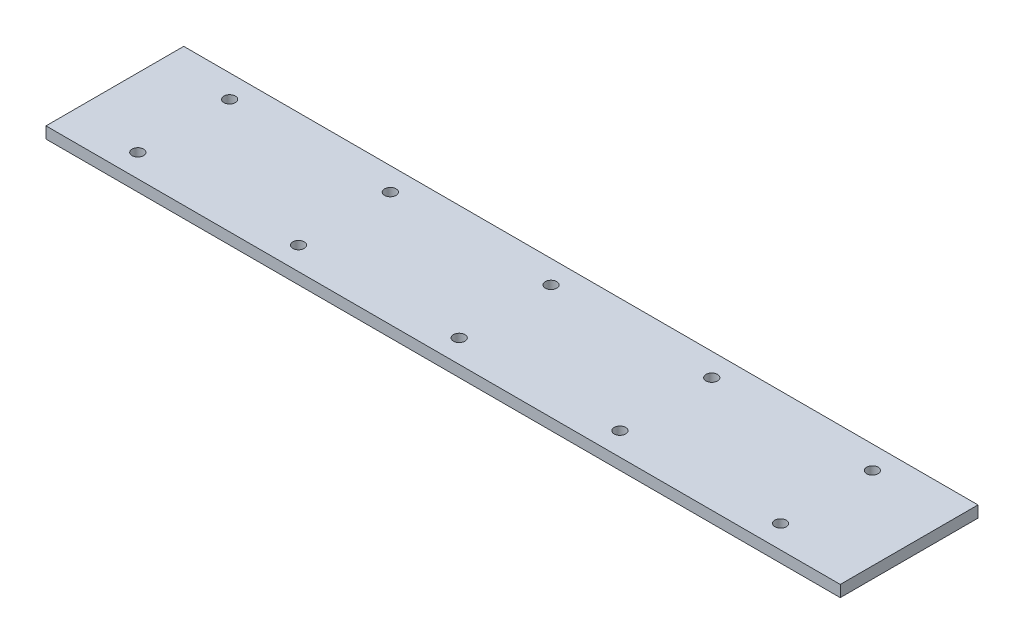
ISO-10303-21;
HEADER;
FILE_DESCRIPTION(('STEP AP214'),'2;1');
FILE_NAME('part.step','',(''),(''),'','','');
FILE_SCHEMA(('AUTOMOTIVE_DESIGN { 1 0 10303 214 1 1 1 1 }'));
ENDSEC;
DATA;
#1=APPLICATION_CONTEXT('core data for automotive mechanical design processes');
#2=APPLICATION_PROTOCOL_DEFINITION('international standard','automotive_design',2000,#1);
#3=PRODUCT_CONTEXT('',#1,'mechanical');
#4=PRODUCT('Part','Part','',(#3));
#5=PRODUCT_RELATED_PRODUCT_CATEGORY('part','',(#4));
#6=PRODUCT_DEFINITION_FORMATION('','',#4);
#7=PRODUCT_DEFINITION_CONTEXT('part definition',#1,'design');
#8=PRODUCT_DEFINITION('design','',#6,#7);
#9=PRODUCT_DEFINITION_SHAPE('','',#8);
#10=(LENGTH_UNIT() NAMED_UNIT(*) SI_UNIT(.MILLI.,.METRE.));
#11=(NAMED_UNIT(*) PLANE_ANGLE_UNIT() SI_UNIT($,.RADIAN.));
#12=(NAMED_UNIT(*) SI_UNIT($,.STERADIAN.) SOLID_ANGLE_UNIT());
#13=UNCERTAINTY_MEASURE_WITH_UNIT(LENGTH_MEASURE(1.E-05),#10,'distance_accuracy_value','');
#14=(GEOMETRIC_REPRESENTATION_CONTEXT(3) GLOBAL_UNCERTAINTY_ASSIGNED_CONTEXT((#13)) GLOBAL_UNIT_ASSIGNED_CONTEXT((#10,
#11,#12)) REPRESENTATION_CONTEXT('',''));
#15=CARTESIAN_POINT('',(0.,0.,0.));
#16=DIRECTION('',(0.,0.,1.));
#17=DIRECTION('',(1.,0.,0.));
#18=AXIS2_PLACEMENT_3D('',#15,#16,#17);
#19=CARTESIAN_POINT('',(0.,5.,0.));
#20=DIRECTION('',(0.,-1.,0.));
#21=DIRECTION('',(0.,0.,-1.));
#22=AXIS2_PLACEMENT_3D('',#19,#20,#21);
#23=PLANE('',#22);
#24=DIRECTION('',(0.,0.,1.));
#25=VECTOR('',#24,1.);
#26=CARTESIAN_POINT('',(0.,5.,0.));
#27=LINE('',#26,#25);
#28=CARTESIAN_POINT('',(0.,5.,-60.));
#29=VERTEX_POINT('',#28);
#30=CARTESIAN_POINT('',(0.,5.,0.));
#31=VERTEX_POINT('',#30);
#32=EDGE_CURVE('E98',#29,#31,#27,.T.);
#33=ORIENTED_EDGE('',*,*,#32,.T.);
#34=DIRECTION('',(1.,0.,0.));
#35=VECTOR('',#34,1.);
#36=CARTESIAN_POINT('',(0.,5.,0.));
#37=LINE('',#36,#35);
#38=CARTESIAN_POINT('',(346.,5.,0.));
#39=VERTEX_POINT('',#38);
#40=EDGE_CURVE('E93',#31,#39,#37,.T.);
#41=ORIENTED_EDGE('',*,*,#40,.T.);
#42=DIRECTION('',(0.,0.,-1.));
#43=VECTOR('',#42,1.);
#44=CARTESIAN_POINT('',(346.,5.,0.));
#45=LINE('',#44,#43);
#46=CARTESIAN_POINT('',(346.,5.,-60.));
#47=VERTEX_POINT('',#46);
#48=EDGE_CURVE('E96',#39,#47,#45,.T.);
#49=ORIENTED_EDGE('',*,*,#48,.T.);
#50=DIRECTION('',(-1.,0.,0.));
#51=VECTOR('',#50,1.);
#52=CARTESIAN_POINT('',(0.,5.,-60.));
#53=LINE('',#52,#51);
#54=EDGE_CURVE('E63',#47,#29,#53,.T.);
#55=ORIENTED_EDGE('',*,*,#54,.T.);
#56=EDGE_LOOP('',(#33,#41,#49,#55));
#57=FACE_BOUND('',#56,.T.);
#58=CARTESIAN_POINT('',(30.,5.,-50.));
#59=DIRECTION('',(0.,1.,0.));
#60=DIRECTION('',(0.,0.,1.));
#61=AXIS2_PLACEMENT_3D('',#58,#59,#60);
#62=CIRCLE('',#61,2.5);
#63=CARTESIAN_POINT('',(30.,5.,-47.5));
#64=VERTEX_POINT('',#63);
#65=EDGE_CURVE('E118',#64,#64,#62,.T.);
#66=ORIENTED_EDGE('',*,*,#65,.F.);
#67=EDGE_LOOP('',(#66));
#68=FACE_BOUND('',#67,.T.);
#69=CARTESIAN_POINT('',(100.,5.,-50.));
#70=DIRECTION('',(0.,1.,0.));
#71=DIRECTION('',(0.,0.,1.));
#72=AXIS2_PLACEMENT_3D('',#69,#70,#71);
#73=CIRCLE('',#72,2.5);
#74=CARTESIAN_POINT('',(100.,5.,-47.5));
#75=VERTEX_POINT('',#74);
#76=EDGE_CURVE('E140',#75,#75,#73,.T.);
#77=ORIENTED_EDGE('',*,*,#76,.F.);
#78=EDGE_LOOP('',(#77));
#79=FACE_BOUND('',#78,.T.);
#80=CARTESIAN_POINT('',(170.,5.,-50.));
#81=DIRECTION('',(0.,1.,0.));
#82=DIRECTION('',(0.,0.,1.));
#83=AXIS2_PLACEMENT_3D('',#80,#81,#82);
#84=CIRCLE('',#83,2.5);
#85=CARTESIAN_POINT('',(170.,5.,-47.5));
#86=VERTEX_POINT('',#85);
#87=EDGE_CURVE('E148',#86,#86,#84,.T.);
#88=ORIENTED_EDGE('',*,*,#87,.F.);
#89=EDGE_LOOP('',(#88));
#90=FACE_BOUND('',#89,.T.);
#91=CARTESIAN_POINT('',(240.,5.,-50.));
#92=DIRECTION('',(0.,1.,0.));
#93=DIRECTION('',(0.,0.,1.));
#94=AXIS2_PLACEMENT_3D('',#91,#92,#93);
#95=CIRCLE('',#94,2.5);
#96=CARTESIAN_POINT('',(240.,5.,-47.5));
#97=VERTEX_POINT('',#96);
#98=EDGE_CURVE('E156',#97,#97,#95,.T.);
#99=ORIENTED_EDGE('',*,*,#98,.F.);
#100=EDGE_LOOP('',(#99));
#101=FACE_BOUND('',#100,.T.);
#102=CARTESIAN_POINT('',(310.,5.,-50.));
#103=DIRECTION('',(0.,1.,0.));
#104=DIRECTION('',(0.,0.,1.));
#105=AXIS2_PLACEMENT_3D('',#102,#103,#104);
#106=CIRCLE('',#105,2.50000000000002);
#107=CARTESIAN_POINT('',(310.,5.,-47.5));
#108=VERTEX_POINT('',#107);
#109=EDGE_CURVE('E164',#108,#108,#106,.T.);
#110=ORIENTED_EDGE('',*,*,#109,.F.);
#111=EDGE_LOOP('',(#110));
#112=FACE_BOUND('',#111,.T.);
#113=CARTESIAN_POINT('',(310.,5.,-10.));
#114=DIRECTION('',(0.,1.,0.));
#115=DIRECTION('',(0.,0.,-1.));
#116=AXIS2_PLACEMENT_3D('',#113,#114,#115);
#117=CIRCLE('',#116,2.50000000000002);
#118=CARTESIAN_POINT('',(310.,5.,-12.5));
#119=VERTEX_POINT('',#118);
#120=EDGE_CURVE('E172',#119,#119,#117,.T.);
#121=ORIENTED_EDGE('',*,*,#120,.F.);
#122=EDGE_LOOP('',(#121));
#123=FACE_BOUND('',#122,.T.);
#124=CARTESIAN_POINT('',(240.,5.,-10.));
#125=DIRECTION('',(0.,1.,0.));
#126=DIRECTION('',(0.,0.,-1.));
#127=AXIS2_PLACEMENT_3D('',#124,#125,#126);
#128=CIRCLE('',#127,2.5);
#129=CARTESIAN_POINT('',(240.,5.,-12.5));
#130=VERTEX_POINT('',#129);
#131=EDGE_CURVE('E180',#130,#130,#128,.T.);
#132=ORIENTED_EDGE('',*,*,#131,.F.);
#133=EDGE_LOOP('',(#132));
#134=FACE_BOUND('',#133,.T.);
#135=CARTESIAN_POINT('',(170.,5.,-10.));
#136=DIRECTION('',(0.,1.,0.));
#137=DIRECTION('',(0.,0.,-1.));
#138=AXIS2_PLACEMENT_3D('',#135,#136,#137);
#139=CIRCLE('',#138,2.5);
#140=CARTESIAN_POINT('',(170.,5.,-12.5));
#141=VERTEX_POINT('',#140);
#142=EDGE_CURVE('E188',#141,#141,#139,.T.);
#143=ORIENTED_EDGE('',*,*,#142,.F.);
#144=EDGE_LOOP('',(#143));
#145=FACE_BOUND('',#144,.T.);
#146=CARTESIAN_POINT('',(100.,5.,-10.));
#147=DIRECTION('',(0.,1.,0.));
#148=DIRECTION('',(0.,0.,-1.));
#149=AXIS2_PLACEMENT_3D('',#146,#147,#148);
#150=CIRCLE('',#149,2.5);
#151=CARTESIAN_POINT('',(100.,5.,-12.5));
#152=VERTEX_POINT('',#151);
#153=EDGE_CURVE('E196',#152,#152,#150,.T.);
#154=ORIENTED_EDGE('',*,*,#153,.F.);
#155=EDGE_LOOP('',(#154));
#156=FACE_BOUND('',#155,.T.);
#157=CARTESIAN_POINT('',(30.,5.,-10.));
#158=DIRECTION('',(0.,1.,0.));
#159=DIRECTION('',(0.,0.,-1.));
#160=AXIS2_PLACEMENT_3D('',#157,#158,#159);
#161=CIRCLE('',#160,2.5);
#162=CARTESIAN_POINT('',(30.,5.,-12.5));
#163=VERTEX_POINT('',#162);
#164=EDGE_CURVE('E204',#163,#163,#161,.T.);
#165=ORIENTED_EDGE('',*,*,#164,.F.);
#166=EDGE_LOOP('',(#165));
#167=FACE_BOUND('',#166,.T.);
#168=ADVANCED_FACE('F45',(#57,#68,#79,#90,#101,#112,#123,#134,#145,#156,#167),#23,.F.);
#169=CARTESIAN_POINT('',(0.,0.,0.));
#170=DIRECTION('',(0.,-1.,0.));
#171=DIRECTION('',(0.,0.,-1.));
#172=AXIS2_PLACEMENT_3D('',#169,#170,#171);
#173=PLANE('',#172);
#174=CARTESIAN_POINT('',(100.,0.,-10.));
#175=DIRECTION('',(0.,1.,0.));
#176=DIRECTION('',(0.,0.,-1.));
#177=AXIS2_PLACEMENT_3D('',#174,#175,#176);
#178=CIRCLE('',#177,2.5);
#179=CARTESIAN_POINT('',(100.,0.,-12.5));
#180=VERTEX_POINT('',#179);
#181=EDGE_CURVE('E200',#180,#180,#178,.T.);
#182=ORIENTED_EDGE('',*,*,#181,.T.);
#183=EDGE_LOOP('',(#182));
#184=FACE_BOUND('',#183,.T.);
#185=CARTESIAN_POINT('',(240.,0.,-10.));
#186=DIRECTION('',(0.,1.,0.));
#187=DIRECTION('',(0.,0.,-1.));
#188=AXIS2_PLACEMENT_3D('',#185,#186,#187);
#189=CIRCLE('',#188,2.5);
#190=CARTESIAN_POINT('',(240.,0.,-12.5));
#191=VERTEX_POINT('',#190);
#192=EDGE_CURVE('E184',#191,#191,#189,.T.);
#193=ORIENTED_EDGE('',*,*,#192,.T.);
#194=EDGE_LOOP('',(#193));
#195=FACE_BOUND('',#194,.T.);
#196=CARTESIAN_POINT('',(310.,0.,-50.));
#197=DIRECTION('',(0.,1.,0.));
#198=DIRECTION('',(0.,0.,1.));
#199=AXIS2_PLACEMENT_3D('',#196,#197,#198);
#200=CIRCLE('',#199,2.50000000000002);
#201=CARTESIAN_POINT('',(310.,0.,-47.5));
#202=VERTEX_POINT('',#201);
#203=EDGE_CURVE('E168',#202,#202,#200,.T.);
#204=ORIENTED_EDGE('',*,*,#203,.T.);
#205=EDGE_LOOP('',(#204));
#206=FACE_BOUND('',#205,.T.);
#207=CARTESIAN_POINT('',(170.,0.,-50.));
#208=DIRECTION('',(0.,1.,0.));
#209=DIRECTION('',(0.,0.,1.));
#210=AXIS2_PLACEMENT_3D('',#207,#208,#209);
#211=CIRCLE('',#210,2.5);
#212=CARTESIAN_POINT('',(170.,0.,-47.5));
#213=VERTEX_POINT('',#212);
#214=EDGE_CURVE('E152',#213,#213,#211,.T.);
#215=ORIENTED_EDGE('',*,*,#214,.T.);
#216=EDGE_LOOP('',(#215));
#217=FACE_BOUND('',#216,.T.);
#218=CARTESIAN_POINT('',(30.,0.,-50.));
#219=DIRECTION('',(0.,1.,0.));
#220=DIRECTION('',(0.,0.,1.));
#221=AXIS2_PLACEMENT_3D('',#218,#219,#220);
#222=CIRCLE('',#221,2.5);
#223=CARTESIAN_POINT('',(30.,0.,-47.5));
#224=VERTEX_POINT('',#223);
#225=EDGE_CURVE('E136',#224,#224,#222,.T.);
#226=ORIENTED_EDGE('',*,*,#225,.T.);
#227=EDGE_LOOP('',(#226));
#228=FACE_BOUND('',#227,.T.);
#229=DIRECTION('',(0.,0.,1.));
#230=VECTOR('',#229,1.);
#231=CARTESIAN_POINT('',(0.,0.,0.));
#232=LINE('',#231,#230);
#233=CARTESIAN_POINT('',(0.,0.,-60.));
#234=VERTEX_POINT('',#233);
#235=CARTESIAN_POINT('',(0.,0.,0.));
#236=VERTEX_POINT('',#235);
#237=EDGE_CURVE('E114',#234,#236,#232,.T.);
#238=ORIENTED_EDGE('',*,*,#237,.F.);
#239=DIRECTION('',(-1.,0.,0.));
#240=VECTOR('',#239,1.);
#241=CARTESIAN_POINT('',(0.,0.,-60.));
#242=LINE('',#241,#240);
#243=CARTESIAN_POINT('',(346.,0.,-60.));
#244=VERTEX_POINT('',#243);
#245=EDGE_CURVE('E86',#244,#234,#242,.T.);
#246=ORIENTED_EDGE('',*,*,#245,.F.);
#247=DIRECTION('',(0.,0.,-1.));
#248=VECTOR('',#247,1.);
#249=CARTESIAN_POINT('',(346.,0.,0.));
#250=LINE('',#249,#248);
#251=CARTESIAN_POINT('',(346.,0.,0.));
#252=VERTEX_POINT('',#251);
#253=EDGE_CURVE('E80',#252,#244,#250,.T.);
#254=ORIENTED_EDGE('',*,*,#253,.F.);
#255=DIRECTION('',(1.,0.,0.));
#256=VECTOR('',#255,1.);
#257=CARTESIAN_POINT('',(0.,0.,0.));
#258=LINE('',#257,#256);
#259=EDGE_CURVE('E103',#236,#252,#258,.T.);
#260=ORIENTED_EDGE('',*,*,#259,.F.);
#261=EDGE_LOOP('',(#238,#246,#254,#260));
#262=FACE_BOUND('',#261,.T.);
#263=CARTESIAN_POINT('',(100.,0.,-50.));
#264=DIRECTION('',(0.,1.,0.));
#265=DIRECTION('',(0.,0.,1.));
#266=AXIS2_PLACEMENT_3D('',#263,#264,#265);
#267=CIRCLE('',#266,2.5);
#268=CARTESIAN_POINT('',(100.,0.,-47.5));
#269=VERTEX_POINT('',#268);
#270=EDGE_CURVE('E144',#269,#269,#267,.T.);
#271=ORIENTED_EDGE('',*,*,#270,.T.);
#272=EDGE_LOOP('',(#271));
#273=FACE_BOUND('',#272,.T.);
#274=CARTESIAN_POINT('',(240.,0.,-50.));
#275=DIRECTION('',(0.,1.,0.));
#276=DIRECTION('',(0.,0.,1.));
#277=AXIS2_PLACEMENT_3D('',#274,#275,#276);
#278=CIRCLE('',#277,2.5);
#279=CARTESIAN_POINT('',(240.,0.,-47.5));
#280=VERTEX_POINT('',#279);
#281=EDGE_CURVE('E160',#280,#280,#278,.T.);
#282=ORIENTED_EDGE('',*,*,#281,.T.);
#283=EDGE_LOOP('',(#282));
#284=FACE_BOUND('',#283,.T.);
#285=CARTESIAN_POINT('',(310.,0.,-10.));
#286=DIRECTION('',(0.,1.,0.));
#287=DIRECTION('',(0.,0.,-1.));
#288=AXIS2_PLACEMENT_3D('',#285,#286,#287);
#289=CIRCLE('',#288,2.50000000000002);
#290=CARTESIAN_POINT('',(310.,0.,-12.5));
#291=VERTEX_POINT('',#290);
#292=EDGE_CURVE('E176',#291,#291,#289,.T.);
#293=ORIENTED_EDGE('',*,*,#292,.T.);
#294=EDGE_LOOP('',(#293));
#295=FACE_BOUND('',#294,.T.);
#296=CARTESIAN_POINT('',(170.,0.,-10.));
#297=DIRECTION('',(0.,1.,0.));
#298=DIRECTION('',(0.,0.,-1.));
#299=AXIS2_PLACEMENT_3D('',#296,#297,#298);
#300=CIRCLE('',#299,2.5);
#301=CARTESIAN_POINT('',(170.,0.,-12.5));
#302=VERTEX_POINT('',#301);
#303=EDGE_CURVE('E192',#302,#302,#300,.T.);
#304=ORIENTED_EDGE('',*,*,#303,.T.);
#305=EDGE_LOOP('',(#304));
#306=FACE_BOUND('',#305,.T.);
#307=CARTESIAN_POINT('',(30.,0.,-10.));
#308=DIRECTION('',(0.,1.,0.));
#309=DIRECTION('',(0.,0.,-1.));
#310=AXIS2_PLACEMENT_3D('',#307,#308,#309);
#311=CIRCLE('',#310,2.5);
#312=CARTESIAN_POINT('',(30.,0.,-12.5));
#313=VERTEX_POINT('',#312);
#314=EDGE_CURVE('E208',#313,#313,#311,.T.);
#315=ORIENTED_EDGE('',*,*,#314,.T.);
#316=EDGE_LOOP('',(#315));
#317=FACE_BOUND('',#316,.T.);
#318=ADVANCED_FACE('F131',(#184,#195,#206,#217,#228,#262,#273,#284,#295,#306,#317),#173,.T.);
#319=CARTESIAN_POINT('',(0.,5.,0.));
#320=DIRECTION('',(1.,0.,0.));
#321=DIRECTION('',(0.,0.,-1.));
#322=AXIS2_PLACEMENT_3D('',#319,#320,#321);
#323=PLANE('',#322);
#324=ORIENTED_EDGE('',*,*,#237,.T.);
#325=DIRECTION('',(0.,-1.,0.));
#326=VECTOR('',#325,1.);
#327=CARTESIAN_POINT('',(0.,5.,0.));
#328=LINE('',#327,#326);
#329=EDGE_CURVE('E11',#31,#236,#328,.T.);
#330=ORIENTED_EDGE('',*,*,#329,.F.);
#331=ORIENTED_EDGE('',*,*,#32,.F.);
#332=DIRECTION('',(0.,-1.,0.));
#333=VECTOR('',#332,1.);
#334=CARTESIAN_POINT('',(0.,5.,-60.));
#335=LINE('',#334,#333);
#336=EDGE_CURVE('E110',#29,#234,#335,.T.);
#337=ORIENTED_EDGE('',*,*,#336,.T.);
#338=EDGE_LOOP('',(#324,#330,#331,#337));
#339=FACE_BOUND('',#338,.T.);
#340=ADVANCED_FACE('F47',(#339),#323,.F.);
#341=CARTESIAN_POINT('',(0.,5.,0.));
#342=DIRECTION('',(0.,0.,-1.));
#343=DIRECTION('',(-1.,0.,0.));
#344=AXIS2_PLACEMENT_3D('',#341,#342,#343);
#345=PLANE('',#344);
#346=ORIENTED_EDGE('',*,*,#259,.T.);
#347=DIRECTION('',(0.,-1.,0.));
#348=VECTOR('',#347,1.);
#349=CARTESIAN_POINT('',(346.,5.,0.));
#350=LINE('',#349,#348);
#351=EDGE_CURVE('E55',#39,#252,#350,.T.);
#352=ORIENTED_EDGE('',*,*,#351,.F.);
#353=ORIENTED_EDGE('',*,*,#40,.F.);
#354=ORIENTED_EDGE('',*,*,#329,.T.);
#355=EDGE_LOOP('',(#346,#352,#353,#354));
#356=FACE_BOUND('',#355,.T.);
#357=ADVANCED_FACE('F102',(#356),#345,.F.);
#358=CARTESIAN_POINT('',(346.,5.,0.));
#359=DIRECTION('',(-1.,0.,0.));
#360=DIRECTION('',(0.,0.,1.));
#361=AXIS2_PLACEMENT_3D('',#358,#359,#360);
#362=PLANE('',#361);
#363=ORIENTED_EDGE('',*,*,#253,.T.);
#364=DIRECTION('',(0.,-1.,0.));
#365=VECTOR('',#364,1.);
#366=CARTESIAN_POINT('',(346.,5.,-60.));
#367=LINE('',#366,#365);
#368=EDGE_CURVE('E105',#47,#244,#367,.T.);
#369=ORIENTED_EDGE('',*,*,#368,.F.);
#370=ORIENTED_EDGE('',*,*,#48,.F.);
#371=ORIENTED_EDGE('',*,*,#351,.T.);
#372=EDGE_LOOP('',(#363,#369,#370,#371));
#373=FACE_BOUND('',#372,.T.);
#374=ADVANCED_FACE('F106',(#373),#362,.F.);
#375=CARTESIAN_POINT('',(0.,5.,-60.));
#376=DIRECTION('',(0.,0.,1.));
#377=DIRECTION('',(1.,0.,0.));
#378=AXIS2_PLACEMENT_3D('',#375,#376,#377);
#379=PLANE('',#378);
#380=ORIENTED_EDGE('',*,*,#245,.T.);
#381=ORIENTED_EDGE('',*,*,#336,.F.);
#382=ORIENTED_EDGE('',*,*,#54,.F.);
#383=ORIENTED_EDGE('',*,*,#368,.T.);
#384=EDGE_LOOP('',(#380,#381,#382,#383));
#385=FACE_BOUND('',#384,.T.);
#386=ADVANCED_FACE('F128',(#385),#379,.F.);
#387=CARTESIAN_POINT('',(30.,5.,-50.));
#388=DIRECTION('',(0.,-1.,0.));
#389=DIRECTION('',(0.,0.,-1.));
#390=AXIS2_PLACEMENT_3D('',#387,#388,#389);
#391=CYLINDRICAL_SURFACE('',#390,2.5);
#392=ORIENTED_EDGE('',*,*,#65,.T.);
#393=EDGE_LOOP('',(#392));
#394=FACE_BOUND('',#393,.T.);
#395=ORIENTED_EDGE('',*,*,#225,.F.);
#396=EDGE_LOOP('',(#395));
#397=FACE_BOUND('',#396,.T.);
#398=ADVANCED_FACE('F227',(#394,#397),#391,.F.);
#399=CARTESIAN_POINT('',(100.,5.,-50.));
#400=DIRECTION('',(0.,-1.,0.));
#401=DIRECTION('',(0.,0.,-1.));
#402=AXIS2_PLACEMENT_3D('',#399,#400,#401);
#403=CYLINDRICAL_SURFACE('',#402,2.5);
#404=ORIENTED_EDGE('',*,*,#76,.T.);
#405=EDGE_LOOP('',(#404));
#406=FACE_BOUND('',#405,.T.);
#407=ORIENTED_EDGE('',*,*,#270,.F.);
#408=EDGE_LOOP('',(#407));
#409=FACE_BOUND('',#408,.T.);
#410=ADVANCED_FACE('F272',(#406,#409),#403,.F.);
#411=CARTESIAN_POINT('',(170.,5.,-50.));
#412=DIRECTION('',(0.,-1.,0.));
#413=DIRECTION('',(0.,0.,-1.));
#414=AXIS2_PLACEMENT_3D('',#411,#412,#413);
#415=CYLINDRICAL_SURFACE('',#414,2.5);
#416=ORIENTED_EDGE('',*,*,#87,.T.);
#417=EDGE_LOOP('',(#416));
#418=FACE_BOUND('',#417,.T.);
#419=ORIENTED_EDGE('',*,*,#214,.F.);
#420=EDGE_LOOP('',(#419));
#421=FACE_BOUND('',#420,.T.);
#422=ADVANCED_FACE('F280',(#418,#421),#415,.F.);
#423=CARTESIAN_POINT('',(240.,5.,-50.));
#424=DIRECTION('',(0.,-1.,0.));
#425=DIRECTION('',(0.,0.,-1.));
#426=AXIS2_PLACEMENT_3D('',#423,#424,#425);
#427=CYLINDRICAL_SURFACE('',#426,2.5);
#428=ORIENTED_EDGE('',*,*,#98,.T.);
#429=EDGE_LOOP('',(#428));
#430=FACE_BOUND('',#429,.T.);
#431=ORIENTED_EDGE('',*,*,#281,.F.);
#432=EDGE_LOOP('',(#431));
#433=FACE_BOUND('',#432,.T.);
#434=ADVANCED_FACE('F288',(#430,#433),#427,.F.);
#435=CARTESIAN_POINT('',(310.,5.,-50.));
#436=DIRECTION('',(0.,-1.,0.));
#437=DIRECTION('',(0.,0.,-1.));
#438=AXIS2_PLACEMENT_3D('',#435,#436,#437);
#439=CYLINDRICAL_SURFACE('',#438,2.50000000000002);
#440=ORIENTED_EDGE('',*,*,#109,.T.);
#441=EDGE_LOOP('',(#440));
#442=FACE_BOUND('',#441,.T.);
#443=ORIENTED_EDGE('',*,*,#203,.F.);
#444=EDGE_LOOP('',(#443));
#445=FACE_BOUND('',#444,.T.);
#446=ADVANCED_FACE('F297',(#442,#445),#439,.F.);
#447=CARTESIAN_POINT('',(310.,5.,-10.));
#448=DIRECTION('',(0.,-1.,0.));
#449=DIRECTION('',(0.,0.,-1.));
#450=AXIS2_PLACEMENT_3D('',#447,#448,#449);
#451=CYLINDRICAL_SURFACE('',#450,2.50000000000002);
#452=ORIENTED_EDGE('',*,*,#120,.T.);
#453=EDGE_LOOP('',(#452));
#454=FACE_BOUND('',#453,.T.);
#455=ORIENTED_EDGE('',*,*,#292,.F.);
#456=EDGE_LOOP('',(#455));
#457=FACE_BOUND('',#456,.T.);
#458=ADVANCED_FACE('F306',(#454,#457),#451,.F.);
#459=CARTESIAN_POINT('',(240.,5.,-10.));
#460=DIRECTION('',(0.,-1.,0.));
#461=DIRECTION('',(0.,0.,-1.));
#462=AXIS2_PLACEMENT_3D('',#459,#460,#461);
#463=CYLINDRICAL_SURFACE('',#462,2.5);
#464=ORIENTED_EDGE('',*,*,#131,.T.);
#465=EDGE_LOOP('',(#464));
#466=FACE_BOUND('',#465,.T.);
#467=ORIENTED_EDGE('',*,*,#192,.F.);
#468=EDGE_LOOP('',(#467));
#469=FACE_BOUND('',#468,.T.);
#470=ADVANCED_FACE('F315',(#466,#469),#463,.F.);
#471=CARTESIAN_POINT('',(170.,5.,-10.));
#472=DIRECTION('',(0.,-1.,0.));
#473=DIRECTION('',(0.,0.,-1.));
#474=AXIS2_PLACEMENT_3D('',#471,#472,#473);
#475=CYLINDRICAL_SURFACE('',#474,2.5);
#476=ORIENTED_EDGE('',*,*,#142,.T.);
#477=EDGE_LOOP('',(#476));
#478=FACE_BOUND('',#477,.T.);
#479=ORIENTED_EDGE('',*,*,#303,.F.);
#480=EDGE_LOOP('',(#479));
#481=FACE_BOUND('',#480,.T.);
#482=ADVANCED_FACE('F324',(#478,#481),#475,.F.);
#483=CARTESIAN_POINT('',(100.,5.,-10.));
#484=DIRECTION('',(0.,-1.,0.));
#485=DIRECTION('',(0.,0.,-1.));
#486=AXIS2_PLACEMENT_3D('',#483,#484,#485);
#487=CYLINDRICAL_SURFACE('',#486,2.5);
#488=ORIENTED_EDGE('',*,*,#153,.T.);
#489=EDGE_LOOP('',(#488));
#490=FACE_BOUND('',#489,.T.);
#491=ORIENTED_EDGE('',*,*,#181,.F.);
#492=EDGE_LOOP('',(#491));
#493=FACE_BOUND('',#492,.T.);
#494=ADVANCED_FACE('F333',(#490,#493),#487,.F.);
#495=CARTESIAN_POINT('',(30.,5.,-10.));
#496=DIRECTION('',(0.,-1.,0.));
#497=DIRECTION('',(0.,0.,-1.));
#498=AXIS2_PLACEMENT_3D('',#495,#496,#497);
#499=CYLINDRICAL_SURFACE('',#498,2.5);
#500=ORIENTED_EDGE('',*,*,#164,.T.);
#501=EDGE_LOOP('',(#500));
#502=FACE_BOUND('',#501,.T.);
#503=ORIENTED_EDGE('',*,*,#314,.F.);
#504=EDGE_LOOP('',(#503));
#505=FACE_BOUND('',#504,.T.);
#506=ADVANCED_FACE('F216',(#502,#505),#499,.F.);
#507=CLOSED_SHELL('',(#168,#318,#340,#357,#374,#386,#398,#410,#422,#434,#446,#458,#470,#482,
#494,#506));
#508=MANIFOLD_SOLID_BREP('B2',#507);
#509=ADVANCED_BREP_SHAPE_REPRESENTATION('',(#18,#508),#14);
#510=SHAPE_DEFINITION_REPRESENTATION(#9,#509);
ENDSEC;
END-ISO-10303-21;
